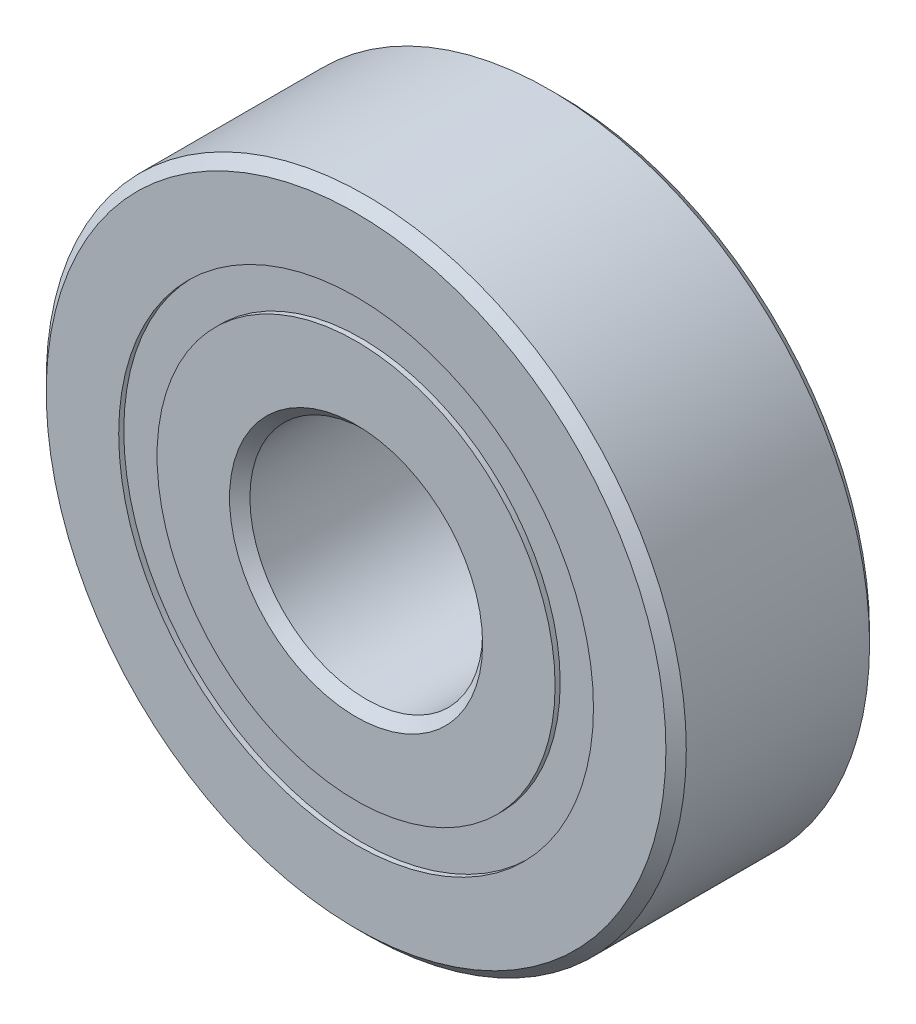
ISO-10303-21;
HEADER;
FILE_DESCRIPTION(('STEP AP214'),'2;1');
FILE_NAME('part.step','',(''),(''),'','','');
FILE_SCHEMA(('AUTOMOTIVE_DESIGN { 1 0 10303 214 1 1 1 1 }'));
ENDSEC;
DATA;
#1=APPLICATION_CONTEXT('core data for automotive mechanical design processes');
#2=APPLICATION_PROTOCOL_DEFINITION('international standard','automotive_design',2000,#1);
#3=PRODUCT_CONTEXT('',#1,'mechanical');
#4=PRODUCT('Part','Part','',(#3));
#5=PRODUCT_RELATED_PRODUCT_CATEGORY('part','',(#4));
#6=PRODUCT_DEFINITION_FORMATION('','',#4);
#7=PRODUCT_DEFINITION_CONTEXT('part definition',#1,'design');
#8=PRODUCT_DEFINITION('design','',#6,#7);
#9=PRODUCT_DEFINITION_SHAPE('','',#8);
#10=(LENGTH_UNIT() NAMED_UNIT(*) SI_UNIT(.MILLI.,.METRE.));
#11=(NAMED_UNIT(*) PLANE_ANGLE_UNIT() SI_UNIT($,.RADIAN.));
#12=(NAMED_UNIT(*) SI_UNIT($,.STERADIAN.) SOLID_ANGLE_UNIT());
#13=UNCERTAINTY_MEASURE_WITH_UNIT(LENGTH_MEASURE(1.E-05),#10,'distance_accuracy_value','');
#14=(GEOMETRIC_REPRESENTATION_CONTEXT(3) GLOBAL_UNCERTAINTY_ASSIGNED_CONTEXT((#13)) GLOBAL_UNIT_ASSIGNED_CONTEXT((#10,
#11,#12)) REPRESENTATION_CONTEXT('',''));
#15=CARTESIAN_POINT('',(0.,0.,0.));
#16=DIRECTION('',(0.,0.,1.));
#17=DIRECTION('',(1.,0.,0.));
#18=AXIS2_PLACEMENT_3D('',#15,#16,#17);
#19=CARTESIAN_POINT('',(0.,8.15934065934066,-3.325));
#20=DIRECTION('',(0.,0.,1.));
#21=DIRECTION('',(1.,0.,0.));
#22=AXIS2_PLACEMENT_3D('',#19,#20,#21);
#23=PLANE('',#22);
#24=CARTESIAN_POINT('',(0.,0.,-3.325));
#25=DIRECTION('',(0.,0.,1.));
#26=DIRECTION('',(1.,0.,0.));
#27=AXIS2_PLACEMENT_3D('',#24,#25,#26);
#28=CIRCLE('',#27,8.15934065934066);
#29=CARTESIAN_POINT('',(8.15934065934066,0.,-3.325));
#30=VERTEX_POINT('',#29);
#31=EDGE_CURVE('E61',#30,#30,#28,.T.);
#32=ORIENTED_EDGE('',*,*,#31,.F.);
#33=EDGE_LOOP('',(#32));
#34=FACE_BOUND('',#33,.T.);
#35=CARTESIAN_POINT('',(0.,0.,-3.325));
#36=DIRECTION('',(0.,0.,1.));
#37=DIRECTION('',(1.,0.,0.));
#38=AXIS2_PLACEMENT_3D('',#35,#36,#37);
#39=CIRCLE('',#38,6.84065934065934);
#40=CARTESIAN_POINT('',(6.84065934065934,0.,-3.325));
#41=VERTEX_POINT('',#40);
#42=EDGE_CURVE('E11',#41,#41,#39,.T.);
#43=ORIENTED_EDGE('',*,*,#42,.T.);
#44=EDGE_LOOP('',(#43));
#45=FACE_BOUND('',#44,.T.);
#46=ADVANCED_FACE('F47',(#34,#45),#23,.F.);
#47=CARTESIAN_POINT('',(0.,0.,3.5));
#48=DIRECTION('',(0.,0.,1.));
#49=DIRECTION('',(1.,0.,0.));
#50=AXIS2_PLACEMENT_3D('',#47,#48,#49);
#51=CYLINDRICAL_SURFACE('',#50,6.84065934065934);
#52=ORIENTED_EDGE('',*,*,#42,.F.);
#53=EDGE_LOOP('',(#52));
#54=FACE_BOUND('',#53,.T.);
#55=CARTESIAN_POINT('',(0.,0.,-1.68952158656808));
#56=DIRECTION('',(0.,0.,1.));
#57=DIRECTION('',(1.,0.,0.));
#58=AXIS2_PLACEMENT_3D('',#55,#56,#57);
#59=CIRCLE('',#58,6.84065934065934);
#60=CARTESIAN_POINT('',(6.84065934065934,0.,-1.68952158656808));
#61=VERTEX_POINT('',#60);
#62=EDGE_CURVE('E53',#61,#61,#59,.T.);
#63=ORIENTED_EDGE('',*,*,#62,.T.);
#64=EDGE_LOOP('',(#63));
#65=FACE_BOUND('',#64,.T.);
#66=ADVANCED_FACE('F70',(#54,#65),#51,.F.);
#67=CARTESIAN_POINT('',(0.,8.15934065934066,-1.68952158656808));
#68=DIRECTION('',(0.,0.,-1.));
#69=DIRECTION('',(-1.,0.,0.));
#70=AXIS2_PLACEMENT_3D('',#67,#68,#69);
#71=PLANE('',#70);
#72=ORIENTED_EDGE('',*,*,#62,.F.);
#73=EDGE_LOOP('',(#72));
#74=FACE_BOUND('',#73,.T.);
#75=CARTESIAN_POINT('',(0.,0.,-1.68952158656808));
#76=DIRECTION('',(0.,0.,1.));
#77=DIRECTION('',(1.,0.,0.));
#78=AXIS2_PLACEMENT_3D('',#75,#76,#77);
#79=CIRCLE('',#78,8.15934065934066);
#80=CARTESIAN_POINT('',(8.15934065934066,0.,-1.68952158656808));
#81=VERTEX_POINT('',#80);
#82=EDGE_CURVE('E57',#81,#81,#79,.T.);
#83=ORIENTED_EDGE('',*,*,#82,.T.);
#84=EDGE_LOOP('',(#83));
#85=FACE_BOUND('',#84,.T.);
#86=ADVANCED_FACE('F74',(#74,#85),#71,.F.);
#87=CARTESIAN_POINT('',(0.,0.,3.5));
#88=DIRECTION('',(0.,0.,1.));
#89=DIRECTION('',(1.,0.,0.));
#90=AXIS2_PLACEMENT_3D('',#87,#88,#89);
#91=CYLINDRICAL_SURFACE('',#90,8.15934065934066);
#92=ORIENTED_EDGE('',*,*,#82,.F.);
#93=EDGE_LOOP('',(#92));
#94=FACE_BOUND('',#93,.T.);
#95=ORIENTED_EDGE('',*,*,#31,.T.);
#96=EDGE_LOOP('',(#95));
#97=FACE_BOUND('',#96,.T.);
#98=ADVANCED_FACE('F67',(#94,#97),#91,.T.);
#99=CLOSED_SHELL('',(#46,#66,#86,#98));
#100=MANIFOLD_SOLID_BREP('B2',#99);
#101=CARTESIAN_POINT('',(0.,8.15934065934066,3.325));
#102=DIRECTION('',(0.,0.,-1.));
#103=DIRECTION('',(-1.,0.,0.));
#104=AXIS2_PLACEMENT_3D('',#101,#102,#103);
#105=PLANE('',#104);
#106=CARTESIAN_POINT('',(0.,0.,3.325));
#107=DIRECTION('',(0.,0.,1.));
#108=DIRECTION('',(1.,0.,0.));
#109=AXIS2_PLACEMENT_3D('',#106,#107,#108);
#110=CIRCLE('',#109,6.84065934065934);
#111=CARTESIAN_POINT('',(6.84065934065934,0.,3.325));
#112=VERTEX_POINT('',#111);
#113=EDGE_CURVE('E46',#112,#112,#110,.T.);
#114=ORIENTED_EDGE('',*,*,#113,.F.);
#115=EDGE_LOOP('',(#114));
#116=FACE_BOUND('',#115,.T.);
#117=CARTESIAN_POINT('',(0.,0.,3.325));
#118=DIRECTION('',(0.,0.,1.));
#119=DIRECTION('',(1.,0.,0.));
#120=AXIS2_PLACEMENT_3D('',#117,#118,#119);
#121=CIRCLE('',#120,8.15934065934066);
#122=CARTESIAN_POINT('',(8.15934065934066,0.,3.325));
#123=VERTEX_POINT('',#122);
#124=EDGE_CURVE('E129',#123,#123,#121,.T.);
#125=ORIENTED_EDGE('',*,*,#124,.T.);
#126=EDGE_LOOP('',(#125));
#127=FACE_BOUND('',#126,.T.);
#128=ADVANCED_FACE('F115',(#116,#127),#105,.F.);
#129=CARTESIAN_POINT('',(0.,0.,3.5));
#130=DIRECTION('',(0.,0.,1.));
#131=DIRECTION('',(1.,0.,0.));
#132=AXIS2_PLACEMENT_3D('',#129,#130,#131);
#133=CYLINDRICAL_SURFACE('',#132,6.84065934065934);
#134=CARTESIAN_POINT('',(0.,0.,1.68952158656808));
#135=DIRECTION('',(0.,0.,1.));
#136=DIRECTION('',(1.,0.,0.));
#137=AXIS2_PLACEMENT_3D('',#134,#135,#136);
#138=CIRCLE('',#137,6.84065934065934);
#139=CARTESIAN_POINT('',(6.84065934065934,0.,1.68952158656808));
#140=VERTEX_POINT('',#139);
#141=EDGE_CURVE('E121',#140,#140,#138,.T.);
#142=ORIENTED_EDGE('',*,*,#141,.F.);
#143=EDGE_LOOP('',(#142));
#144=FACE_BOUND('',#143,.T.);
#145=ORIENTED_EDGE('',*,*,#113,.T.);
#146=EDGE_LOOP('',(#145));
#147=FACE_BOUND('',#146,.T.);
#148=ADVANCED_FACE('F144',(#144,#147),#133,.F.);
#149=CARTESIAN_POINT('',(0.,8.15934065934066,1.68952158656808));
#150=DIRECTION('',(0.,0.,1.));
#151=DIRECTION('',(1.,0.,0.));
#152=AXIS2_PLACEMENT_3D('',#149,#150,#151);
#153=PLANE('',#152);
#154=CARTESIAN_POINT('',(0.,0.,1.68952158656808));
#155=DIRECTION('',(0.,0.,1.));
#156=DIRECTION('',(1.,0.,0.));
#157=AXIS2_PLACEMENT_3D('',#154,#155,#156);
#158=CIRCLE('',#157,8.15934065934066);
#159=CARTESIAN_POINT('',(8.15934065934066,0.,1.68952158656808));
#160=VERTEX_POINT('',#159);
#161=EDGE_CURVE('E125',#160,#160,#158,.T.);
#162=ORIENTED_EDGE('',*,*,#161,.F.);
#163=EDGE_LOOP('',(#162));
#164=FACE_BOUND('',#163,.T.);
#165=ORIENTED_EDGE('',*,*,#141,.T.);
#166=EDGE_LOOP('',(#165));
#167=FACE_BOUND('',#166,.T.);
#168=ADVANCED_FACE('F139',(#164,#167),#153,.F.);
#169=CARTESIAN_POINT('',(0.,0.,3.5));
#170=DIRECTION('',(0.,0.,1.));
#171=DIRECTION('',(1.,0.,0.));
#172=AXIS2_PLACEMENT_3D('',#169,#170,#171);
#173=CYLINDRICAL_SURFACE('',#172,8.15934065934066);
#174=ORIENTED_EDGE('',*,*,#124,.F.);
#175=EDGE_LOOP('',(#174));
#176=FACE_BOUND('',#175,.T.);
#177=ORIENTED_EDGE('',*,*,#161,.T.);
#178=EDGE_LOOP('',(#177));
#179=FACE_BOUND('',#178,.T.);
#180=ADVANCED_FACE('F136',(#176,#179),#173,.T.);
#181=CLOSED_SHELL('',(#128,#148,#168,#180));
#182=MANIFOLD_SOLID_BREP('B6',#181);
#183=CARTESIAN_POINT('',(-3.74999999999992,6.49519052838334,0.));
#184=DIRECTION('',(0.,0.,1.));
#185=DIRECTION('',(-0.499999999999989,0.866025403784445,0.));
#186=AXIS2_PLACEMENT_3D('',#183,#184,#185);
#187=SPHERICAL_SURFACE('',#186,1.68952158656808);
#188=CARTESIAN_POINT('',(-3.74999999999992,6.49519052838334,1.68952158656808));
#189=VERTEX_POINT('',#188);
#190=VERTEX_LOOP('',#189);
#191=FACE_BOUND('',#190,.T.);
#192=ADVANCED_FACE('F185',(#191),#187,.T.);
#193=CLOSED_SHELL('',(#192));
#194=MANIFOLD_SOLID_BREP('B41',#193);
#195=CARTESIAN_POINT('',(-6.49519052838325,3.75000000000008,0.));
#196=DIRECTION('',(0.,0.,1.));
#197=DIRECTION('',(-0.866025403784433,0.50000000000001,0.));
#198=AXIS2_PLACEMENT_3D('',#195,#196,#197);
#199=SPHERICAL_SURFACE('',#198,1.68952158656808);
#200=CARTESIAN_POINT('',(-6.49519052838325,3.75000000000008,1.68952158656808));
#201=VERTEX_POINT('',#200);
#202=VERTEX_LOOP('',#201);
#203=FACE_BOUND('',#202,.T.);
#204=ADVANCED_FACE('F205',(#203),#199,.T.);
#205=CLOSED_SHELL('',(#204));
#206=MANIFOLD_SOLID_BREP('B111',#205);
#207=CARTESIAN_POINT('',(-7.5,0.,0.));
#208=DIRECTION('',(0.,0.,1.));
#209=DIRECTION('',(-1.,0.,0.));
#210=AXIS2_PLACEMENT_3D('',#207,#208,#209);
#211=SPHERICAL_SURFACE('',#210,1.68952158656808);
#212=CARTESIAN_POINT('',(-7.5,0.,1.68952158656808));
#213=VERTEX_POINT('',#212);
#214=VERTEX_LOOP('',#213);
#215=FACE_BOUND('',#214,.T.);
#216=ADVANCED_FACE('F225',(#215),#211,.T.);
#217=CLOSED_SHELL('',(#216));
#218=MANIFOLD_SOLID_BREP('B181',#217);
#219=CARTESIAN_POINT('',(-6.49519052838332,-3.74999999999994,0.));
#220=DIRECTION('',(0.,0.,1.));
#221=DIRECTION('',(-0.866025403784443,-0.499999999999992,0.));
#222=AXIS2_PLACEMENT_3D('',#219,#220,#221);
#223=SPHERICAL_SURFACE('',#222,1.68952158656808);
#224=CARTESIAN_POINT('',(-6.49519052838332,-3.74999999999994,1.68952158656808));
#225=VERTEX_POINT('',#224);
#226=VERTEX_LOOP('',#225);
#227=FACE_BOUND('',#226,.T.);
#228=ADVANCED_FACE('F245',(#227),#223,.T.);
#229=CLOSED_SHELL('',(#228));
#230=MANIFOLD_SOLID_BREP('B201',#229);
#231=CARTESIAN_POINT('',(-3.75000000000005,-6.49519052838326,0.));
#232=DIRECTION('',(0.,0.,1.));
#233=DIRECTION('',(-0.500000000000007,-0.866025403784435,0.));
#234=AXIS2_PLACEMENT_3D('',#231,#232,#233);
#235=SPHERICAL_SURFACE('',#234,1.68952158656808);
#236=CARTESIAN_POINT('',(-3.75000000000005,-6.49519052838326,1.68952158656808));
#237=VERTEX_POINT('',#236);
#238=VERTEX_LOOP('',#237);
#239=FACE_BOUND('',#238,.T.);
#240=ADVANCED_FACE('F265',(#239),#235,.T.);
#241=CLOSED_SHELL('',(#240));
#242=MANIFOLD_SOLID_BREP('B221',#241);
#243=CARTESIAN_POINT('',(0.,-7.5,0.));
#244=DIRECTION('',(0.,0.,1.));
#245=DIRECTION('',(0.,-1.,0.));
#246=AXIS2_PLACEMENT_3D('',#243,#244,#245);
#247=SPHERICAL_SURFACE('',#246,1.68952158656808);
#248=CARTESIAN_POINT('',(0.,-7.5,1.68952158656808));
#249=VERTEX_POINT('',#248);
#250=VERTEX_LOOP('',#249);
#251=FACE_BOUND('',#250,.T.);
#252=ADVANCED_FACE('F285',(#251),#247,.T.);
#253=CLOSED_SHELL('',(#252));
#254=MANIFOLD_SOLID_BREP('B241',#253);
#255=CARTESIAN_POINT('',(3.74999999999996,-6.49519052838331,0.));
#256=DIRECTION('',(0.,0.,1.));
#257=DIRECTION('',(0.499999999999995,-0.866025403784442,0.));
#258=AXIS2_PLACEMENT_3D('',#255,#256,#257);
#259=SPHERICAL_SURFACE('',#258,1.68952158656808);
#260=CARTESIAN_POINT('',(3.74999999999996,-6.49519052838331,1.68952158656808));
#261=VERTEX_POINT('',#260);
#262=VERTEX_LOOP('',#261);
#263=FACE_BOUND('',#262,.T.);
#264=ADVANCED_FACE('F305',(#263),#259,.T.);
#265=CLOSED_SHELL('',(#264));
#266=MANIFOLD_SOLID_BREP('B261',#265);
#267=CARTESIAN_POINT('',(6.49519052838327,-3.75000000000003,0.));
#268=DIRECTION('',(0.,0.,1.));
#269=DIRECTION('',(0.866025403784436,-0.500000000000004,0.));
#270=AXIS2_PLACEMENT_3D('',#267,#268,#269);
#271=SPHERICAL_SURFACE('',#270,1.68952158656808);
#272=CARTESIAN_POINT('',(6.49519052838327,-3.75000000000003,1.68952158656808));
#273=VERTEX_POINT('',#272);
#274=VERTEX_LOOP('',#273);
#275=FACE_BOUND('',#274,.T.);
#276=ADVANCED_FACE('F325',(#275),#271,.T.);
#277=CLOSED_SHELL('',(#276));
#278=MANIFOLD_SOLID_BREP('B281',#277);
#279=CARTESIAN_POINT('',(7.5,0.,0.));
#280=DIRECTION('',(0.,0.,1.));
#281=DIRECTION('',(1.,0.,0.));
#282=AXIS2_PLACEMENT_3D('',#279,#280,#281);
#283=SPHERICAL_SURFACE('',#282,1.68952158656808);
#284=CARTESIAN_POINT('',(7.5,0.,1.68952158656808));
#285=VERTEX_POINT('',#284);
#286=VERTEX_LOOP('',#285);
#287=FACE_BOUND('',#286,.T.);
#288=ADVANCED_FACE('F346',(#287),#283,.T.);
#289=CLOSED_SHELL('',(#288));
#290=MANIFOLD_SOLID_BREP('B301',#289);
#291=CARTESIAN_POINT('',(6.4951905283833,3.74999999999998,0.));
#292=DIRECTION('',(0.,0.,1.));
#293=DIRECTION('',(0.86602540378444,0.499999999999998,0.));
#294=AXIS2_PLACEMENT_3D('',#291,#292,#293);
#295=SPHERICAL_SURFACE('',#294,1.68952158656808);
#296=CARTESIAN_POINT('',(6.4951905283833,3.74999999999998,1.68952158656808));
#297=VERTEX_POINT('',#296);
#298=VERTEX_LOOP('',#297);
#299=FACE_BOUND('',#298,.T.);
#300=ADVANCED_FACE('F369',(#299),#295,.T.);
#301=CLOSED_SHELL('',(#300));
#302=MANIFOLD_SOLID_BREP('B321',#301);
#303=CARTESIAN_POINT('',(3.75000000000001,6.49519052838328,0.));
#304=DIRECTION('',(0.,0.,1.));
#305=DIRECTION('',(0.500000000000001,0.866025403784438,0.));
#306=AXIS2_PLACEMENT_3D('',#303,#304,#305);
#307=SPHERICAL_SURFACE('',#306,1.68952158656808);
#308=CARTESIAN_POINT('',(3.75000000000001,6.49519052838328,1.68952158656808));
#309=VERTEX_POINT('',#308);
#310=VERTEX_LOOP('',#309);
#311=FACE_BOUND('',#310,.T.);
#312=ADVANCED_FACE('F389',(#311),#307,.T.);
#313=CLOSED_SHELL('',(#312));
#314=MANIFOLD_SOLID_BREP('B342',#313);
#315=CARTESIAN_POINT('',(0.,7.5,0.));
#316=DIRECTION('',(0.,0.,1.));
#317=DIRECTION('',(0.,1.,0.));
#318=AXIS2_PLACEMENT_3D('',#315,#316,#317);
#319=SPHERICAL_SURFACE('',#318,1.68952158656808);
#320=CARTESIAN_POINT('',(0.,7.5,1.68952158656808));
#321=VERTEX_POINT('',#320);
#322=VERTEX_LOOP('',#321);
#323=FACE_BOUND('',#322,.T.);
#324=ADVANCED_FACE('F412',(#323),#319,.T.);
#325=CLOSED_SHELL('',(#324));
#326=MANIFOLD_SOLID_BREP('B365',#325);
#327=CARTESIAN_POINT('',(0.,6.84065934065934,3.5));
#328=DIRECTION('',(0.,0.,-1.));
#329=DIRECTION('',(-1.,0.,0.));
#330=AXIS2_PLACEMENT_3D('',#327,#328,#329);
#331=PLANE('',#330);
#332=CARTESIAN_POINT('',(0.,0.,3.5));
#333=DIRECTION('',(0.,0.,1.));
#334=DIRECTION('',(1.,0.,0.));
#335=AXIS2_PLACEMENT_3D('',#332,#333,#334);
#336=CIRCLE('',#335,4.35);
#337=CARTESIAN_POINT('',(4.35,0.,3.5));
#338=VERTEX_POINT('',#337);
#339=EDGE_CURVE('E463',#338,#338,#336,.T.);
#340=ORIENTED_EDGE('',*,*,#339,.F.);
#341=EDGE_LOOP('',(#340));
#342=FACE_BOUND('',#341,.T.);
#343=CARTESIAN_POINT('',(0.,0.,3.5));
#344=DIRECTION('',(0.,0.,1.));
#345=DIRECTION('',(1.,0.,0.));
#346=AXIS2_PLACEMENT_3D('',#343,#344,#345);
#347=CIRCLE('',#346,6.84065934065934);
#348=CARTESIAN_POINT('',(6.84065934065934,0.,3.5));
#349=VERTEX_POINT('',#348);
#350=EDGE_CURVE('E411',#349,#349,#347,.T.);
#351=ORIENTED_EDGE('',*,*,#350,.T.);
#352=EDGE_LOOP('',(#351));
#353=FACE_BOUND('',#352,.T.);
#354=ADVANCED_FACE('F435',(#342,#353),#331,.F.);
#355=CARTESIAN_POINT('',(0.,0.,3.5));
#356=DIRECTION('',(0.,0.,1.));
#357=DIRECTION('',(1.,0.,0.));
#358=AXIS2_PLACEMENT_3D('',#355,#356,#357);
#359=CYLINDRICAL_SURFACE('',#358,6.84065934065934);
#360=ORIENTED_EDGE('',*,*,#350,.F.);
#361=EDGE_LOOP('',(#360));
#362=FACE_BOUND('',#361,.T.);
#363=CARTESIAN_POINT('',(0.,0.,1.55555555555556));
#364=DIRECTION('',(0.,0.,1.));
#365=DIRECTION('',(1.,0.,0.));
#366=AXIS2_PLACEMENT_3D('',#363,#364,#365);
#367=CIRCLE('',#366,6.84065934065934);
#368=CARTESIAN_POINT('',(6.84065934065934,0.,1.55555555555556));
#369=VERTEX_POINT('',#368);
#370=EDGE_CURVE('E441',#369,#369,#367,.T.);
#371=ORIENTED_EDGE('',*,*,#370,.T.);
#372=EDGE_LOOP('',(#371));
#373=FACE_BOUND('',#372,.T.);
#374=ADVANCED_FACE('F470',(#362,#373),#359,.T.);
#375=CARTESIAN_POINT('',(0.,0.,0.));
#376=DIRECTION('',(0.,0.,1.));
#377=DIRECTION('',(1.,0.,0.));
#378=AXIS2_PLACEMENT_3D('',#375,#376,#377);
#379=TOROIDAL_SURFACE('',#378,7.49999999999999,1.68952158656808);
#380=ORIENTED_EDGE('',*,*,#370,.F.);
#381=EDGE_LOOP('',(#380));
#382=FACE_BOUND('',#381,.T.);
#383=CARTESIAN_POINT('',(0.,0.,-1.55555555555556));
#384=DIRECTION('',(0.,0.,1.));
#385=DIRECTION('',(1.,0.,0.));
#386=AXIS2_PLACEMENT_3D('',#383,#384,#385);
#387=CIRCLE('',#386,6.84065934065934);
#388=CARTESIAN_POINT('',(6.84065934065934,0.,-1.55555555555556));
#389=VERTEX_POINT('',#388);
#390=EDGE_CURVE('E445',#389,#389,#387,.T.);
#391=ORIENTED_EDGE('',*,*,#390,.T.);
#392=EDGE_LOOP('',(#391));
#393=FACE_BOUND('',#392,.T.);
#394=ADVANCED_FACE('F474',(#382,#393),#379,.F.);
#395=CARTESIAN_POINT('',(0.,0.,3.5));
#396=DIRECTION('',(0.,0.,1.));
#397=DIRECTION('',(1.,0.,0.));
#398=AXIS2_PLACEMENT_3D('',#395,#396,#397);
#399=CYLINDRICAL_SURFACE('',#398,6.84065934065934);
#400=ORIENTED_EDGE('',*,*,#390,.F.);
#401=EDGE_LOOP('',(#400));
#402=FACE_BOUND('',#401,.T.);
#403=CARTESIAN_POINT('',(0.,0.,-3.5));
#404=DIRECTION('',(0.,0.,1.));
#405=DIRECTION('',(1.,0.,0.));
#406=AXIS2_PLACEMENT_3D('',#403,#404,#405);
#407=CIRCLE('',#406,6.84065934065934);
#408=CARTESIAN_POINT('',(6.84065934065934,0.,-3.5));
#409=VERTEX_POINT('',#408);
#410=EDGE_CURVE('E449',#409,#409,#407,.T.);
#411=ORIENTED_EDGE('',*,*,#410,.T.);
#412=EDGE_LOOP('',(#411));
#413=FACE_BOUND('',#412,.T.);
#414=ADVANCED_FACE('F479',(#402,#413),#399,.T.);
#415=CARTESIAN_POINT('',(0.,4.35,-3.5));
#416=DIRECTION('',(0.,0.,1.));
#417=DIRECTION('',(1.,0.,0.));
#418=AXIS2_PLACEMENT_3D('',#415,#416,#417);
#419=PLANE('',#418);
#420=ORIENTED_EDGE('',*,*,#410,.F.);
#421=EDGE_LOOP('',(#420));
#422=FACE_BOUND('',#421,.T.);
#423=CARTESIAN_POINT('',(0.,0.,-3.5));
#424=DIRECTION('',(0.,0.,1.));
#425=DIRECTION('',(1.,0.,0.));
#426=AXIS2_PLACEMENT_3D('',#423,#424,#425);
#427=CIRCLE('',#426,4.35);
#428=CARTESIAN_POINT('',(4.35,0.,-3.5));
#429=VERTEX_POINT('',#428);
#430=EDGE_CURVE('E454',#429,#429,#427,.T.);
#431=ORIENTED_EDGE('',*,*,#430,.T.);
#432=EDGE_LOOP('',(#431));
#433=FACE_BOUND('',#432,.T.);
#434=ADVANCED_FACE('F485',(#422,#433),#419,.F.);
#435=CARTESIAN_POINT('',(0.,0.,-3.15));
#436=DIRECTION('',(0.,0.,-1.));
#437=DIRECTION('',(-1.,0.,0.));
#438=AXIS2_PLACEMENT_3D('',#435,#436,#437);
#439=CONICAL_SURFACE('',#438,4.,0.785398163397451);
#440=ORIENTED_EDGE('',*,*,#430,.F.);
#441=EDGE_LOOP('',(#440));
#442=FACE_BOUND('',#441,.T.);
#443=CARTESIAN_POINT('',(0.,0.,-3.15));
#444=DIRECTION('',(0.,0.,1.));
#445=DIRECTION('',(1.,0.,0.));
#446=AXIS2_PLACEMENT_3D('',#443,#444,#445);
#447=CIRCLE('',#446,4.);
#448=CARTESIAN_POINT('',(4.,0.,-3.15));
#449=VERTEX_POINT('',#448);
#450=EDGE_CURVE('E457',#449,#449,#447,.T.);
#451=ORIENTED_EDGE('',*,*,#450,.T.);
#452=EDGE_LOOP('',(#451));
#453=FACE_BOUND('',#452,.T.);
#454=ADVANCED_FACE('F489',(#442,#453),#439,.F.);
#455=CARTESIAN_POINT('',(0.,0.,3.5));
#456=DIRECTION('',(0.,0.,1.));
#457=DIRECTION('',(1.,0.,0.));
#458=AXIS2_PLACEMENT_3D('',#455,#456,#457);
#459=CYLINDRICAL_SURFACE('',#458,4.);
#460=ORIENTED_EDGE('',*,*,#450,.F.);
#461=EDGE_LOOP('',(#460));
#462=FACE_BOUND('',#461,.T.);
#463=CARTESIAN_POINT('',(0.,0.,3.15));
#464=DIRECTION('',(0.,0.,1.));
#465=DIRECTION('',(1.,0.,0.));
#466=AXIS2_PLACEMENT_3D('',#463,#464,#465);
#467=CIRCLE('',#466,4.);
#468=CARTESIAN_POINT('',(4.,0.,3.15));
#469=VERTEX_POINT('',#468);
#470=EDGE_CURVE('E460',#469,#469,#467,.T.);
#471=ORIENTED_EDGE('',*,*,#470,.T.);
#472=EDGE_LOOP('',(#471));
#473=FACE_BOUND('',#472,.T.);
#474=ADVANCED_FACE('F493',(#462,#473),#459,.F.);
#475=CARTESIAN_POINT('',(0.,0.,3.5));
#476=DIRECTION('',(0.,0.,1.));
#477=DIRECTION('',(1.,0.,0.));
#478=AXIS2_PLACEMENT_3D('',#475,#476,#477);
#479=CONICAL_SURFACE('',#478,4.35,0.785398163397447);
#480=ORIENTED_EDGE('',*,*,#470,.F.);
#481=EDGE_LOOP('',(#480));
#482=FACE_BOUND('',#481,.T.);
#483=ORIENTED_EDGE('',*,*,#339,.T.);
#484=EDGE_LOOP('',(#483));
#485=FACE_BOUND('',#484,.T.);
#486=ADVANCED_FACE('F467',(#482,#485),#479,.F.);
#487=CLOSED_SHELL('',(#354,#374,#394,#414,#434,#454,#474,#486));
#488=MANIFOLD_SOLID_BREP('B385',#487);
#489=CARTESIAN_POINT('',(0.,0.,3.15));
#490=DIRECTION('',(0.,0.,-1.));
#491=DIRECTION('',(-1.,0.,0.));
#492=AXIS2_PLACEMENT_3D('',#489,#490,#491);
#493=CONICAL_SURFACE('',#492,11.,0.78539816339745);
#494=CARTESIAN_POINT('',(0.,0.,3.5));
#495=DIRECTION('',(0.,0.,1.));
#496=DIRECTION('',(1.,0.,0.));
#497=AXIS2_PLACEMENT_3D('',#494,#495,#496);
#498=CIRCLE('',#497,10.65);
#499=CARTESIAN_POINT('',(10.65,0.,3.5));
#500=VERTEX_POINT('',#499);
#501=EDGE_CURVE('E587',#500,#500,#498,.T.);
#502=ORIENTED_EDGE('',*,*,#501,.F.);
#503=EDGE_LOOP('',(#502));
#504=FACE_BOUND('',#503,.T.);
#505=CARTESIAN_POINT('',(0.,0.,3.15));
#506=DIRECTION('',(0.,0.,1.));
#507=DIRECTION('',(1.,0.,0.));
#508=AXIS2_PLACEMENT_3D('',#505,#506,#507);
#509=CIRCLE('',#508,11.);
#510=CARTESIAN_POINT('',(11.,0.,3.15));
#511=VERTEX_POINT('',#510);
#512=EDGE_CURVE('E434',#511,#511,#509,.T.);
#513=ORIENTED_EDGE('',*,*,#512,.T.);
#514=EDGE_LOOP('',(#513));
#515=FACE_BOUND('',#514,.T.);
#516=ADVANCED_FACE('F559',(#504,#515),#493,.T.);
#517=CARTESIAN_POINT('',(0.,0.,3.5));
#518=DIRECTION('',(0.,0.,1.));
#519=DIRECTION('',(1.,0.,0.));
#520=AXIS2_PLACEMENT_3D('',#517,#518,#519);
#521=CYLINDRICAL_SURFACE('',#520,11.);
#522=ORIENTED_EDGE('',*,*,#512,.F.);
#523=EDGE_LOOP('',(#522));
#524=FACE_BOUND('',#523,.T.);
#525=CARTESIAN_POINT('',(0.,0.,-3.15));
#526=DIRECTION('',(0.,0.,1.));
#527=DIRECTION('',(1.,0.,0.));
#528=AXIS2_PLACEMENT_3D('',#525,#526,#527);
#529=CIRCLE('',#528,11.);
#530=CARTESIAN_POINT('',(11.,0.,-3.15));
#531=VERTEX_POINT('',#530);
#532=EDGE_CURVE('E565',#531,#531,#529,.T.);
#533=ORIENTED_EDGE('',*,*,#532,.T.);
#534=EDGE_LOOP('',(#533));
#535=FACE_BOUND('',#534,.T.);
#536=ADVANCED_FACE('F594',(#524,#535),#521,.T.);
#537=CARTESIAN_POINT('',(0.,0.,-3.5));
#538=DIRECTION('',(0.,0.,1.));
#539=DIRECTION('',(1.,0.,0.));
#540=AXIS2_PLACEMENT_3D('',#537,#538,#539);
#541=CONICAL_SURFACE('',#540,10.65,0.785398163397448);
#542=ORIENTED_EDGE('',*,*,#532,.F.);
#543=EDGE_LOOP('',(#542));
#544=FACE_BOUND('',#543,.T.);
#545=CARTESIAN_POINT('',(0.,0.,-3.5));
#546=DIRECTION('',(0.,0.,1.));
#547=DIRECTION('',(1.,0.,0.));
#548=AXIS2_PLACEMENT_3D('',#545,#546,#547);
#549=CIRCLE('',#548,10.65);
#550=CARTESIAN_POINT('',(10.65,0.,-3.5));
#551=VERTEX_POINT('',#550);
#552=EDGE_CURVE('E569',#551,#551,#549,.T.);
#553=ORIENTED_EDGE('',*,*,#552,.T.);
#554=EDGE_LOOP('',(#553));
#555=FACE_BOUND('',#554,.T.);
#556=ADVANCED_FACE('F598',(#544,#555),#541,.T.);
#557=CARTESIAN_POINT('',(0.,10.65,-3.5));
#558=DIRECTION('',(0.,0.,1.));
#559=DIRECTION('',(1.,0.,0.));
#560=AXIS2_PLACEMENT_3D('',#557,#558,#559);
#561=PLANE('',#560);
#562=ORIENTED_EDGE('',*,*,#552,.F.);
#563=EDGE_LOOP('',(#562));
#564=FACE_BOUND('',#563,.T.);
#565=CARTESIAN_POINT('',(0.,0.,-3.5));
#566=DIRECTION('',(0.,0.,1.));
#567=DIRECTION('',(1.,0.,0.));
#568=AXIS2_PLACEMENT_3D('',#565,#566,#567);
#569=CIRCLE('',#568,8.15934065934066);
#570=CARTESIAN_POINT('',(8.15934065934066,0.,-3.5));
#571=VERTEX_POINT('',#570);
#572=EDGE_CURVE('E573',#571,#571,#569,.T.);
#573=ORIENTED_EDGE('',*,*,#572,.T.);
#574=EDGE_LOOP('',(#573));
#575=FACE_BOUND('',#574,.T.);
#576=ADVANCED_FACE('F603',(#564,#575),#561,.F.);
#577=CARTESIAN_POINT('',(0.,0.,3.5));
#578=DIRECTION('',(0.,0.,1.));
#579=DIRECTION('',(1.,0.,0.));
#580=AXIS2_PLACEMENT_3D('',#577,#578,#579);
#581=CYLINDRICAL_SURFACE('',#580,8.15934065934066);
#582=ORIENTED_EDGE('',*,*,#572,.F.);
#583=EDGE_LOOP('',(#582));
#584=FACE_BOUND('',#583,.T.);
#585=CARTESIAN_POINT('',(0.,0.,-1.55555555555556));
#586=DIRECTION('',(0.,0.,1.));
#587=DIRECTION('',(1.,0.,0.));
#588=AXIS2_PLACEMENT_3D('',#585,#586,#587);
#589=CIRCLE('',#588,8.15934065934066);
#590=CARTESIAN_POINT('',(8.15934065934066,0.,-1.55555555555556));
#591=VERTEX_POINT('',#590);
#592=EDGE_CURVE('E578',#591,#591,#589,.T.);
#593=ORIENTED_EDGE('',*,*,#592,.T.);
#594=EDGE_LOOP('',(#593));
#595=FACE_BOUND('',#594,.T.);
#596=ADVANCED_FACE('F609',(#584,#595),#581,.F.);
#597=CARTESIAN_POINT('',(0.,0.,0.));
#598=DIRECTION('',(0.,0.,1.));
#599=DIRECTION('',(1.,0.,0.));
#600=AXIS2_PLACEMENT_3D('',#597,#598,#599);
#601=TOROIDAL_SURFACE('',#600,7.5,1.68952158656808);
#602=ORIENTED_EDGE('',*,*,#592,.F.);
#603=EDGE_LOOP('',(#602));
#604=FACE_BOUND('',#603,.T.);
#605=CARTESIAN_POINT('',(0.,0.,1.55555555555556));
#606=DIRECTION('',(0.,0.,1.));
#607=DIRECTION('',(1.,0.,0.));
#608=AXIS2_PLACEMENT_3D('',#605,#606,#607);
#609=CIRCLE('',#608,8.15934065934066);
#610=CARTESIAN_POINT('',(8.15934065934066,0.,1.55555555555556));
#611=VERTEX_POINT('',#610);
#612=EDGE_CURVE('E581',#611,#611,#609,.T.);
#613=ORIENTED_EDGE('',*,*,#612,.T.);
#614=EDGE_LOOP('',(#613));
#615=FACE_BOUND('',#614,.T.);
#616=ADVANCED_FACE('F613',(#604,#615),#601,.F.);
#617=CARTESIAN_POINT('',(0.,0.,3.5));
#618=DIRECTION('',(0.,0.,1.));
#619=DIRECTION('',(1.,0.,0.));
#620=AXIS2_PLACEMENT_3D('',#617,#618,#619);
#621=CYLINDRICAL_SURFACE('',#620,8.15934065934066);
#622=ORIENTED_EDGE('',*,*,#612,.F.);
#623=EDGE_LOOP('',(#622));
#624=FACE_BOUND('',#623,.T.);
#625=CARTESIAN_POINT('',(0.,0.,3.5));
#626=DIRECTION('',(0.,0.,1.));
#627=DIRECTION('',(1.,0.,0.));
#628=AXIS2_PLACEMENT_3D('',#625,#626,#627);
#629=CIRCLE('',#628,8.15934065934066);
#630=CARTESIAN_POINT('',(8.15934065934066,0.,3.5));
#631=VERTEX_POINT('',#630);
#632=EDGE_CURVE('E584',#631,#631,#629,.T.);
#633=ORIENTED_EDGE('',*,*,#632,.T.);
#634=EDGE_LOOP('',(#633));
#635=FACE_BOUND('',#634,.T.);
#636=ADVANCED_FACE('F617',(#624,#635),#621,.F.);
#637=CARTESIAN_POINT('',(0.,10.65,3.5));
#638=DIRECTION('',(0.,0.,-1.));
#639=DIRECTION('',(-1.,0.,0.));
#640=AXIS2_PLACEMENT_3D('',#637,#638,#639);
#641=PLANE('',#640);
#642=ORIENTED_EDGE('',*,*,#632,.F.);
#643=EDGE_LOOP('',(#642));
#644=FACE_BOUND('',#643,.T.);
#645=ORIENTED_EDGE('',*,*,#501,.T.);
#646=EDGE_LOOP('',(#645));
#647=FACE_BOUND('',#646,.T.);
#648=ADVANCED_FACE('F591',(#644,#647),#641,.F.);
#649=CLOSED_SHELL('',(#516,#536,#556,#576,#596,#616,#636,#648));
#650=MANIFOLD_SOLID_BREP('B406',#649);
#651=ADVANCED_BREP_SHAPE_REPRESENTATION('',(#18,#100,#182,#194,#206,#218,#230,#242,#254,#266,
#278,#290,#302,#314,#326,#488,#650),#14);
#652=SHAPE_DEFINITION_REPRESENTATION(#9,#651);
ENDSEC;
END-ISO-10303-21;
